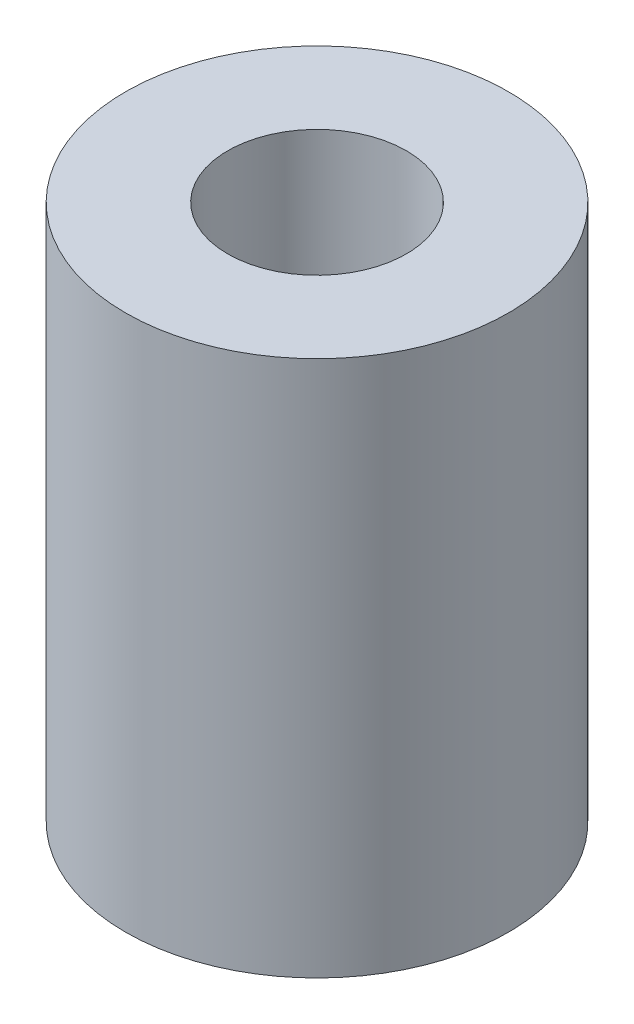
ISO-10303-21;
HEADER;
FILE_DESCRIPTION(('STEP AP214'),'2;1');
FILE_NAME('part.step','',(''),(''),'','','');
FILE_SCHEMA(('AUTOMOTIVE_DESIGN { 1 0 10303 214 1 1 1 1 }'));
ENDSEC;
DATA;
#1=APPLICATION_CONTEXT('core data for automotive mechanical design processes');
#2=APPLICATION_PROTOCOL_DEFINITION('international standard','automotive_design',2000,#1);
#3=PRODUCT_CONTEXT('',#1,'mechanical');
#4=PRODUCT('Part','Part','',(#3));
#5=PRODUCT_RELATED_PRODUCT_CATEGORY('part','',(#4));
#6=PRODUCT_DEFINITION_FORMATION('','',#4);
#7=PRODUCT_DEFINITION_CONTEXT('part definition',#1,'design');
#8=PRODUCT_DEFINITION('design','',#6,#7);
#9=PRODUCT_DEFINITION_SHAPE('','',#8);
#10=(LENGTH_UNIT() NAMED_UNIT(*) SI_UNIT(.MILLI.,.METRE.));
#11=(NAMED_UNIT(*) PLANE_ANGLE_UNIT() SI_UNIT($,.RADIAN.));
#12=(NAMED_UNIT(*) SI_UNIT($,.STERADIAN.) SOLID_ANGLE_UNIT());
#13=UNCERTAINTY_MEASURE_WITH_UNIT(LENGTH_MEASURE(1.E-05),#10,'distance_accuracy_value','');
#14=(GEOMETRIC_REPRESENTATION_CONTEXT(3) GLOBAL_UNCERTAINTY_ASSIGNED_CONTEXT((#13)) GLOBAL_UNIT_ASSIGNED_CONTEXT((#10,
#11,#12)) REPRESENTATION_CONTEXT('',''));
#15=CARTESIAN_POINT('',(0.,0.,0.));
#16=DIRECTION('',(0.,0.,1.));
#17=DIRECTION('',(1.,0.,0.));
#18=AXIS2_PLACEMENT_3D('',#15,#16,#17);
#19=CARTESIAN_POINT('',(0.,10.5,0.));
#20=DIRECTION('',(0.,-1.,0.));
#21=DIRECTION('',(0.,0.,-1.));
#22=AXIS2_PLACEMENT_3D('',#19,#20,#21);
#23=CYLINDRICAL_SURFACE('',#22,3.75);
#24=CARTESIAN_POINT('',(0.,10.5,0.));
#25=DIRECTION('',(0.,1.,0.));
#26=DIRECTION('',(0.,0.,1.));
#27=AXIS2_PLACEMENT_3D('',#24,#25,#26);
#28=CIRCLE('',#27,3.75);
#29=CARTESIAN_POINT('',(0.,10.5,3.75));
#30=VERTEX_POINT('',#29);
#31=EDGE_CURVE('E10',#30,#30,#28,.T.);
#32=ORIENTED_EDGE('',*,*,#31,.F.);
#33=EDGE_LOOP('',(#32));
#34=FACE_BOUND('',#33,.T.);
#35=CARTESIAN_POINT('',(0.,0.,0.));
#36=DIRECTION('',(0.,1.,0.));
#37=DIRECTION('',(0.,0.,1.));
#38=AXIS2_PLACEMENT_3D('',#35,#36,#37);
#39=CIRCLE('',#38,3.75);
#40=CARTESIAN_POINT('',(0.,0.,3.75));
#41=VERTEX_POINT('',#40);
#42=EDGE_CURVE('E46',#41,#41,#39,.T.);
#43=ORIENTED_EDGE('',*,*,#42,.T.);
#44=EDGE_LOOP('',(#43));
#45=FACE_BOUND('',#44,.T.);
#46=ADVANCED_FACE('F43',(#34,#45),#23,.T.);
#47=CARTESIAN_POINT('',(0.,10.5,0.));
#48=DIRECTION('',(0.,1.,0.));
#49=DIRECTION('',(0.,0.,1.));
#50=AXIS2_PLACEMENT_3D('',#47,#48,#49);
#51=PLANE('',#50);
#52=CARTESIAN_POINT('',(0.,10.5,0.));
#53=DIRECTION('',(0.,1.,0.));
#54=DIRECTION('',(0.,0.,1.));
#55=AXIS2_PLACEMENT_3D('',#52,#53,#54);
#56=CIRCLE('',#55,1.75);
#57=CARTESIAN_POINT('',(0.,10.5,1.75));
#58=VERTEX_POINT('',#57);
#59=EDGE_CURVE('E60',#58,#58,#56,.T.);
#60=ORIENTED_EDGE('',*,*,#59,.F.);
#61=EDGE_LOOP('',(#60));
#62=FACE_BOUND('',#61,.T.);
#63=ORIENTED_EDGE('',*,*,#31,.T.);
#64=EDGE_LOOP('',(#63));
#65=FACE_BOUND('',#64,.T.);
#66=ADVANCED_FACE('F67',(#62,#65),#51,.T.);
#67=CARTESIAN_POINT('',(0.,0.,0.));
#68=DIRECTION('',(0.,1.,0.));
#69=DIRECTION('',(0.,0.,1.));
#70=AXIS2_PLACEMENT_3D('',#67,#68,#69);
#71=PLANE('',#70);
#72=CARTESIAN_POINT('',(0.,0.,0.));
#73=DIRECTION('',(0.,1.,0.));
#74=DIRECTION('',(0.,0.,1.));
#75=AXIS2_PLACEMENT_3D('',#72,#73,#74);
#76=CIRCLE('',#75,1.75);
#77=CARTESIAN_POINT('',(0.,0.,1.75));
#78=VERTEX_POINT('',#77);
#79=EDGE_CURVE('E55',#78,#78,#76,.T.);
#80=ORIENTED_EDGE('',*,*,#79,.T.);
#81=EDGE_LOOP('',(#80));
#82=FACE_BOUND('',#81,.T.);
#83=ORIENTED_EDGE('',*,*,#42,.F.);
#84=EDGE_LOOP('',(#83));
#85=FACE_BOUND('',#84,.T.);
#86=ADVANCED_FACE('F69',(#82,#85),#71,.F.);
#87=CARTESIAN_POINT('',(0.,10.5,0.));
#88=DIRECTION('',(0.,1.,0.));
#89=DIRECTION('',(0.,0.,1.));
#90=AXIS2_PLACEMENT_3D('',#87,#88,#89);
#91=CYLINDRICAL_SURFACE('',#90,1.75);
#92=ORIENTED_EDGE('',*,*,#79,.F.);
#93=EDGE_LOOP('',(#92));
#94=FACE_BOUND('',#93,.T.);
#95=ORIENTED_EDGE('',*,*,#59,.T.);
#96=EDGE_LOOP('',(#95));
#97=FACE_BOUND('',#96,.T.);
#98=ADVANCED_FACE('F65',(#94,#97),#91,.F.);
#99=CLOSED_SHELL('',(#46,#66,#86,#98));
#100=MANIFOLD_SOLID_BREP('B2',#99);
#101=ADVANCED_BREP_SHAPE_REPRESENTATION('',(#18,#100),#14);
#102=SHAPE_DEFINITION_REPRESENTATION(#9,#101);
ENDSEC;
END-ISO-10303-21;
